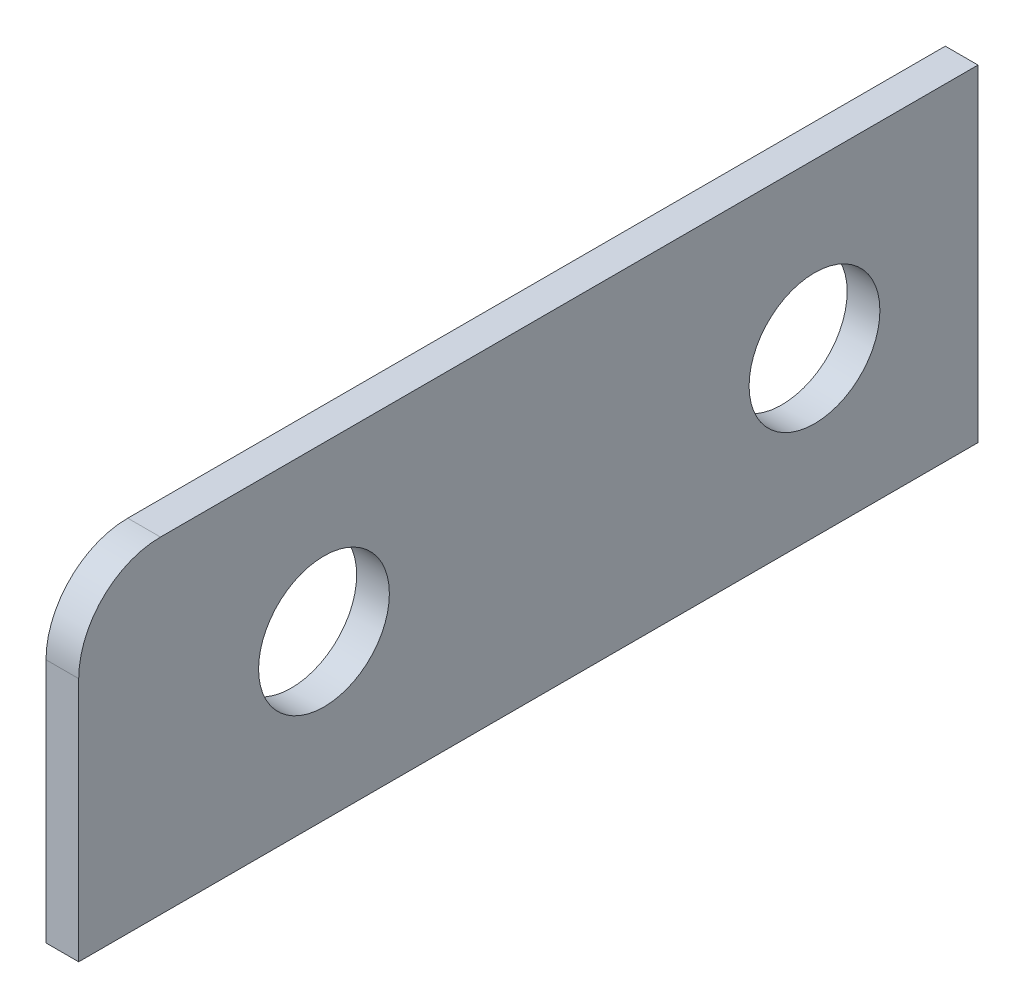
ISO-10303-21;
HEADER;
FILE_DESCRIPTION(('STEP AP214'),'2;1');
FILE_NAME('part.step','',(''),(''),'','','');
FILE_SCHEMA(('AUTOMOTIVE_DESIGN { 1 0 10303 214 1 1 1 1 }'));
ENDSEC;
DATA;
#1=APPLICATION_CONTEXT('core data for automotive mechanical design processes');
#2=APPLICATION_PROTOCOL_DEFINITION('international standard','automotive_design',2000,#1);
#3=PRODUCT_CONTEXT('',#1,'mechanical');
#4=PRODUCT('Part','Part','',(#3));
#5=PRODUCT_RELATED_PRODUCT_CATEGORY('part','',(#4));
#6=PRODUCT_DEFINITION_FORMATION('','',#4);
#7=PRODUCT_DEFINITION_CONTEXT('part definition',#1,'design');
#8=PRODUCT_DEFINITION('design','',#6,#7);
#9=PRODUCT_DEFINITION_SHAPE('','',#8);
#10=(LENGTH_UNIT() NAMED_UNIT(*) SI_UNIT(.MILLI.,.METRE.));
#11=(NAMED_UNIT(*) PLANE_ANGLE_UNIT() SI_UNIT($,.RADIAN.));
#12=(NAMED_UNIT(*) SI_UNIT($,.STERADIAN.) SOLID_ANGLE_UNIT());
#13=UNCERTAINTY_MEASURE_WITH_UNIT(LENGTH_MEASURE(1.E-05),#10,'distance_accuracy_value','');
#14=(GEOMETRIC_REPRESENTATION_CONTEXT(3) GLOBAL_UNCERTAINTY_ASSIGNED_CONTEXT((#13)) GLOBAL_UNIT_ASSIGNED_CONTEXT((#10,
#11,#12)) REPRESENTATION_CONTEXT('',''));
#15=CARTESIAN_POINT('',(0.,0.,0.));
#16=DIRECTION('',(0.,0.,1.));
#17=DIRECTION('',(1.,0.,0.));
#18=AXIS2_PLACEMENT_3D('',#15,#16,#17);
#19=CARTESIAN_POINT('',(1337.,50.,62.0000000000001));
#20=DIRECTION('',(0.,0.,-1.));
#21=DIRECTION('',(-1.,0.,0.));
#22=AXIS2_PLACEMENT_3D('',#19,#20,#21);
#23=PLANE('',#22);
#24=DIRECTION('',(0.,-1.,0.));
#25=VECTOR('',#24,1.);
#26=CARTESIAN_POINT('',(1337.,50.,62.0000000000001));
#27=LINE('',#26,#25);
#28=CARTESIAN_POINT('',(1337.,65.,62.0000000000001));
#29=VERTEX_POINT('',#28);
#30=CARTESIAN_POINT('',(1337.,50.,62.0000000000001));
#31=VERTEX_POINT('',#30);
#32=EDGE_CURVE('E98',#29,#31,#27,.T.);
#33=ORIENTED_EDGE('',*,*,#32,.F.);
#34=DIRECTION('',(-1.,0.,0.));
#35=VECTOR('',#34,1.);
#36=CARTESIAN_POINT('',(1337.,65.,62.0000000000001));
#37=LINE('',#36,#35);
#38=CARTESIAN_POINT('',(1335.,65.,62.0000000000001));
#39=VERTEX_POINT('',#38);
#40=EDGE_CURVE('E110',#29,#39,#37,.T.);
#41=ORIENTED_EDGE('',*,*,#40,.T.);
#42=DIRECTION('',(0.,-1.,0.));
#43=VECTOR('',#42,1.);
#44=CARTESIAN_POINT('',(1335.,50.,62.0000000000001));
#45=LINE('',#44,#43);
#46=CARTESIAN_POINT('',(1335.,50.,62.0000000000001));
#47=VERTEX_POINT('',#46);
#48=EDGE_CURVE('E103',#39,#47,#45,.T.);
#49=ORIENTED_EDGE('',*,*,#48,.T.);
#50=DIRECTION('',(-1.,0.,0.));
#51=VECTOR('',#50,1.);
#52=CARTESIAN_POINT('',(1337.,50.,62.0000000000001));
#53=LINE('',#52,#51);
#54=EDGE_CURVE('E107',#31,#47,#53,.T.);
#55=ORIENTED_EDGE('',*,*,#54,.F.);
#56=EDGE_LOOP('',(#33,#41,#49,#55));
#57=FACE_BOUND('',#56,.T.);
#58=ADVANCED_FACE('F36',(#57),#23,.F.);
#59=CARTESIAN_POINT('',(1337.,50.,62.0000000000001));
#60=DIRECTION('',(0.,1.,0.));
#61=DIRECTION('',(0.,0.,1.));
#62=AXIS2_PLACEMENT_3D('',#59,#60,#61);
#63=PLANE('',#62);
#64=DIRECTION('',(0.,0.,-1.));
#65=VECTOR('',#64,1.);
#66=CARTESIAN_POINT('',(1335.,50.,62.0000000000001));
#67=LINE('',#66,#65);
#68=CARTESIAN_POINT('',(1335.,50.,7.));
#69=VERTEX_POINT('',#68);
#70=EDGE_CURVE('E99',#47,#69,#67,.T.);
#71=ORIENTED_EDGE('',*,*,#70,.T.);
#72=DIRECTION('',(1.,0.,0.));
#73=VECTOR('',#72,1.);
#74=CARTESIAN_POINT('',(1337.,50.,7.));
#75=LINE('',#74,#73);
#76=CARTESIAN_POINT('',(1337.,50.,7.));
#77=VERTEX_POINT('',#76);
#78=EDGE_CURVE('E50',#69,#77,#75,.T.);
#79=ORIENTED_EDGE('',*,*,#78,.T.);
#80=DIRECTION('',(0.,0.,-1.));
#81=VECTOR('',#80,1.);
#82=CARTESIAN_POINT('',(1337.,50.,62.0000000000001));
#83=LINE('',#82,#81);
#84=EDGE_CURVE('E101',#31,#77,#83,.T.);
#85=ORIENTED_EDGE('',*,*,#84,.F.);
#86=ORIENTED_EDGE('',*,*,#54,.T.);
#87=EDGE_LOOP('',(#71,#79,#85,#86));
#88=FACE_BOUND('',#87,.T.);
#89=ADVANCED_FACE('F135',(#88),#63,.F.);
#90=CARTESIAN_POINT('',(1337.,70.,62.0000000000001));
#91=DIRECTION('',(0.,-1.,0.));
#92=DIRECTION('',(0.,0.,-1.));
#93=AXIS2_PLACEMENT_3D('',#90,#91,#92);
#94=PLANE('',#93);
#95=DIRECTION('',(0.,0.,1.));
#96=VECTOR('',#95,1.);
#97=CARTESIAN_POINT('',(1337.,70.,62.0000000000001));
#98=LINE('',#97,#96);
#99=CARTESIAN_POINT('',(1337.,70.,7.));
#100=VERTEX_POINT('',#99);
#101=CARTESIAN_POINT('',(1337.,70.,57.0000000000001));
#102=VERTEX_POINT('',#101);
#103=EDGE_CURVE('E58',#100,#102,#98,.T.);
#104=ORIENTED_EDGE('',*,*,#103,.F.);
#105=DIRECTION('',(1.,0.,0.));
#106=VECTOR('',#105,1.);
#107=CARTESIAN_POINT('',(1194.91074273878,70.,7.));
#108=LINE('',#107,#106);
#109=CARTESIAN_POINT('',(1335.,70.,7.));
#110=VERTEX_POINT('',#109);
#111=EDGE_CURVE('E82',#110,#100,#108,.T.);
#112=ORIENTED_EDGE('',*,*,#111,.F.);
#113=DIRECTION('',(0.,0.,1.));
#114=VECTOR('',#113,1.);
#115=CARTESIAN_POINT('',(1335.,70.,62.0000000000001));
#116=LINE('',#115,#114);
#117=CARTESIAN_POINT('',(1335.,70.,57.0000000000001));
#118=VERTEX_POINT('',#117);
#119=EDGE_CURVE('E89',#110,#118,#116,.T.);
#120=ORIENTED_EDGE('',*,*,#119,.T.);
#121=DIRECTION('',(-1.,0.,0.));
#122=VECTOR('',#121,1.);
#123=CARTESIAN_POINT('',(1337.,70.,57.0000000000001));
#124=LINE('',#123,#122);
#125=EDGE_CURVE('E114',#118,#102,#124,.F.);
#126=ORIENTED_EDGE('',*,*,#125,.T.);
#127=EDGE_LOOP('',(#104,#112,#120,#126));
#128=FACE_BOUND('',#127,.T.);
#129=ADVANCED_FACE('F88',(#128),#94,.F.);
#130=CARTESIAN_POINT('',(1337.,0.,0.));
#131=DIRECTION('',(-1.,0.,0.));
#132=DIRECTION('',(0.,0.,1.));
#133=AXIS2_PLACEMENT_3D('',#130,#131,#132);
#134=PLANE('',#133);
#135=CARTESIAN_POINT('',(1337.,60.,47.0000000000001));
#136=DIRECTION('',(-1.,0.,0.));
#137=DIRECTION('',(0.,0.,1.));
#138=AXIS2_PLACEMENT_3D('',#135,#136,#137);
#139=CIRCLE('',#138,4.00000000000001);
#140=CARTESIAN_POINT('',(1337.,60.,51.0000000000001));
#141=VERTEX_POINT('',#140);
#142=EDGE_CURVE('E217',#141,#141,#139,.T.);
#143=ORIENTED_EDGE('',*,*,#142,.T.);
#144=EDGE_LOOP('',(#143));
#145=FACE_BOUND('',#144,.T.);
#146=CARTESIAN_POINT('',(1337.,60.,17.));
#147=DIRECTION('',(-1.,0.,0.));
#148=DIRECTION('',(0.,0.,1.));
#149=AXIS2_PLACEMENT_3D('',#146,#147,#148);
#150=CIRCLE('',#149,4.);
#151=CARTESIAN_POINT('',(1337.,60.,21.));
#152=VERTEX_POINT('',#151);
#153=EDGE_CURVE('E218',#152,#152,#150,.T.);
#154=ORIENTED_EDGE('',*,*,#153,.T.);
#155=EDGE_LOOP('',(#154));
#156=FACE_BOUND('',#155,.T.);
#157=ORIENTED_EDGE('',*,*,#84,.T.);
#158=DIRECTION('',(0.,1.,0.));
#159=VECTOR('',#158,1.);
#160=CARTESIAN_POINT('',(1337.,0.,6.99999999999999));
#161=LINE('',#160,#159);
#162=EDGE_CURVE('E91',#77,#100,#161,.T.);
#163=ORIENTED_EDGE('',*,*,#162,.T.);
#164=ORIENTED_EDGE('',*,*,#103,.T.);
#165=CARTESIAN_POINT('',(1337.,65.,57.0000000000001));
#166=DIRECTION('',(-1.,0.,0.));
#167=DIRECTION('',(0.,0.,1.));
#168=AXIS2_PLACEMENT_3D('',#165,#166,#167);
#169=CIRCLE('',#168,5.);
#170=EDGE_CURVE('E44',#102,#29,#169,.F.);
#171=ORIENTED_EDGE('',*,*,#170,.T.);
#172=ORIENTED_EDGE('',*,*,#32,.T.);
#173=EDGE_LOOP('',(#157,#163,#164,#171,#172));
#174=FACE_BOUND('',#173,.T.);
#175=ADVANCED_FACE('F118',(#145,#156,#174),#134,.F.);
#176=CARTESIAN_POINT('',(1335.,0.,0.));
#177=DIRECTION('',(-1.,0.,0.));
#178=DIRECTION('',(0.,0.,1.));
#179=AXIS2_PLACEMENT_3D('',#176,#177,#178);
#180=PLANE('',#179);
#181=DIRECTION('',(0.,1.,0.));
#182=VECTOR('',#181,1.);
#183=CARTESIAN_POINT('',(1335.,0.,6.99999999999999));
#184=LINE('',#183,#182);
#185=EDGE_CURVE('E11',#69,#110,#184,.T.);
#186=ORIENTED_EDGE('',*,*,#185,.F.);
#187=ORIENTED_EDGE('',*,*,#70,.F.);
#188=ORIENTED_EDGE('',*,*,#48,.F.);
#189=CARTESIAN_POINT('',(1335.,65.,57.0000000000001));
#190=DIRECTION('',(-1.,0.,0.));
#191=DIRECTION('',(0.,0.,1.));
#192=AXIS2_PLACEMENT_3D('',#189,#190,#191);
#193=CIRCLE('',#192,5.);
#194=EDGE_CURVE('E96',#39,#118,#193,.T.);
#195=ORIENTED_EDGE('',*,*,#194,.T.);
#196=ORIENTED_EDGE('',*,*,#119,.F.);
#197=EDGE_LOOP('',(#186,#187,#188,#195,#196));
#198=FACE_BOUND('',#197,.T.);
#199=CARTESIAN_POINT('',(1335.,60.,47.0000000000001));
#200=DIRECTION('',(1.,0.,0.));
#201=DIRECTION('',(0.,0.,-1.));
#202=AXIS2_PLACEMENT_3D('',#199,#200,#201);
#203=CIRCLE('',#202,4.00000000000001);
#204=CARTESIAN_POINT('',(1335.,60.,43.));
#205=VERTEX_POINT('',#204);
#206=EDGE_CURVE('E214',#205,#205,#203,.F.);
#207=ORIENTED_EDGE('',*,*,#206,.F.);
#208=EDGE_LOOP('',(#207));
#209=FACE_BOUND('',#208,.T.);
#210=CARTESIAN_POINT('',(1335.,60.,17.));
#211=DIRECTION('',(1.,0.,0.));
#212=DIRECTION('',(0.,0.,-1.));
#213=AXIS2_PLACEMENT_3D('',#210,#211,#212);
#214=CIRCLE('',#213,4.);
#215=CARTESIAN_POINT('',(1335.,60.,13.));
#216=VERTEX_POINT('',#215);
#217=EDGE_CURVE('E225',#216,#216,#214,.F.);
#218=ORIENTED_EDGE('',*,*,#217,.F.);
#219=EDGE_LOOP('',(#218));
#220=FACE_BOUND('',#219,.T.);
#221=ADVANCED_FACE('F93',(#198,#209,#220),#180,.T.);
#222=CARTESIAN_POINT('',(1337.,65.,57.0000000000001));
#223=DIRECTION('',(-1.,0.,0.));
#224=DIRECTION('',(0.,0.,1.));
#225=AXIS2_PLACEMENT_3D('',#222,#223,#224);
#226=CYLINDRICAL_SURFACE('',#225,5.);
#227=ORIENTED_EDGE('',*,*,#170,.F.);
#228=ORIENTED_EDGE('',*,*,#125,.F.);
#229=ORIENTED_EDGE('',*,*,#194,.F.);
#230=ORIENTED_EDGE('',*,*,#40,.F.);
#231=EDGE_LOOP('',(#227,#228,#229,#230));
#232=FACE_BOUND('',#231,.T.);
#233=ADVANCED_FACE('F38',(#232),#226,.T.);
#234=CARTESIAN_POINT('',(1323.68629150101,60.,17.));
#235=DIRECTION('',(1.,0.,0.));
#236=DIRECTION('',(0.,0.,-1.));
#237=AXIS2_PLACEMENT_3D('',#234,#235,#236);
#238=CYLINDRICAL_SURFACE('',#237,4.);
#239=ORIENTED_EDGE('',*,*,#217,.T.);
#240=EDGE_LOOP('',(#239));
#241=FACE_BOUND('',#240,.T.);
#242=ORIENTED_EDGE('',*,*,#153,.F.);
#243=EDGE_LOOP('',(#242));
#244=FACE_BOUND('',#243,.T.);
#245=ADVANCED_FACE('F125',(#241,#244),#238,.F.);
#246=CARTESIAN_POINT('',(1323.68629150101,60.,47.0000000000001));
#247=DIRECTION('',(1.,0.,0.));
#248=DIRECTION('',(0.,0.,-1.));
#249=AXIS2_PLACEMENT_3D('',#246,#247,#248);
#250=CYLINDRICAL_SURFACE('',#249,4.00000000000001);
#251=ORIENTED_EDGE('',*,*,#206,.T.);
#252=EDGE_LOOP('',(#251));
#253=FACE_BOUND('',#252,.T.);
#254=ORIENTED_EDGE('',*,*,#142,.F.);
#255=EDGE_LOOP('',(#254));
#256=FACE_BOUND('',#255,.T.);
#257=ADVANCED_FACE('F130',(#253,#256),#250,.F.);
#258=CARTESIAN_POINT('',(1194.91074273878,70.,7.));
#259=DIRECTION('',(0.,0.,1.));
#260=DIRECTION('',(0.,-1.,0.));
#261=AXIS2_PLACEMENT_3D('',#258,#259,#260);
#262=PLANE('',#261);
#263=ORIENTED_EDGE('',*,*,#185,.T.);
#264=ORIENTED_EDGE('',*,*,#111,.T.);
#265=ORIENTED_EDGE('',*,*,#162,.F.);
#266=ORIENTED_EDGE('',*,*,#78,.F.);
#267=EDGE_LOOP('',(#263,#264,#265,#266));
#268=FACE_BOUND('',#267,.T.);
#269=ADVANCED_FACE('F81',(#268),#262,.F.);
#270=CLOSED_SHELL('',(#58,#89,#129,#175,#221,#233,#245,#257,#269));
#271=MANIFOLD_SOLID_BREP('B2',#270);
#272=ADVANCED_BREP_SHAPE_REPRESENTATION('',(#18,#271),#14);
#273=SHAPE_DEFINITION_REPRESENTATION(#9,#272);
ENDSEC;
END-ISO-10303-21;
